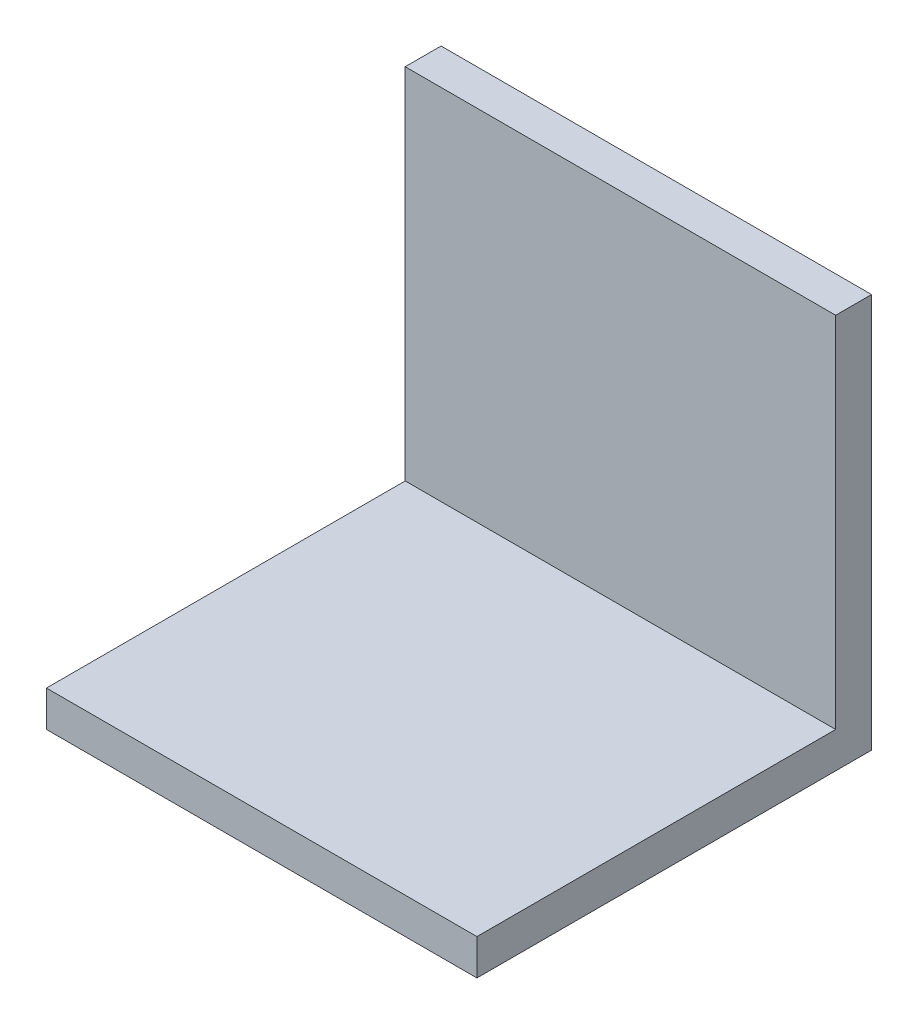
ISO-10303-21;
HEADER;
FILE_DESCRIPTION(('STEP AP214'),'2;1');
FILE_NAME('part.step','',(''),(''),'','','');
FILE_SCHEMA(('AUTOMOTIVE_DESIGN { 1 0 10303 214 1 1 1 1 }'));
ENDSEC;
DATA;
#1=APPLICATION_CONTEXT('core data for automotive mechanical design processes');
#2=APPLICATION_PROTOCOL_DEFINITION('international standard','automotive_design',2000,#1);
#3=PRODUCT_CONTEXT('',#1,'mechanical');
#4=PRODUCT('Part','Part','',(#3));
#5=PRODUCT_RELATED_PRODUCT_CATEGORY('part','',(#4));
#6=PRODUCT_DEFINITION_FORMATION('','',#4);
#7=PRODUCT_DEFINITION_CONTEXT('part definition',#1,'design');
#8=PRODUCT_DEFINITION('design','',#6,#7);
#9=PRODUCT_DEFINITION_SHAPE('','',#8);
#10=(LENGTH_UNIT() NAMED_UNIT(*) SI_UNIT(.MILLI.,.METRE.));
#11=(NAMED_UNIT(*) PLANE_ANGLE_UNIT() SI_UNIT($,.RADIAN.));
#12=(NAMED_UNIT(*) SI_UNIT($,.STERADIAN.) SOLID_ANGLE_UNIT());
#13=UNCERTAINTY_MEASURE_WITH_UNIT(LENGTH_MEASURE(1.E-05),#10,'distance_accuracy_value','');
#14=(GEOMETRIC_REPRESENTATION_CONTEXT(3) GLOBAL_UNCERTAINTY_ASSIGNED_CONTEXT((#13)) GLOBAL_UNIT_ASSIGNED_CONTEXT((#10,
#11,#12)) REPRESENTATION_CONTEXT('',''));
#15=CARTESIAN_POINT('',(0.,0.,0.));
#16=DIRECTION('',(0.,0.,1.));
#17=DIRECTION('',(1.,0.,0.));
#18=AXIS2_PLACEMENT_3D('',#15,#16,#17);
#19=CARTESIAN_POINT('',(0.,0.,3.));
#20=DIRECTION('',(0.,0.,-1.));
#21=DIRECTION('',(-1.,0.,0.));
#22=AXIS2_PLACEMENT_3D('',#19,#20,#21);
#23=PLANE('',#22);
#24=DIRECTION('',(-1.,0.,0.));
#25=VECTOR('',#24,1.);
#26=CARTESIAN_POINT('',(18.,-13.5,3.));
#27=LINE('',#26,#25);
#28=CARTESIAN_POINT('',(18.,-13.5,3.));
#29=VERTEX_POINT('',#28);
#30=CARTESIAN_POINT('',(-18.,-13.5,3.));
#31=VERTEX_POINT('',#30);
#32=EDGE_CURVE('E55',#29,#31,#27,.T.);
#33=ORIENTED_EDGE('',*,*,#32,.F.);
#34=DIRECTION('',(0.,1.,0.));
#35=VECTOR('',#34,1.);
#36=CARTESIAN_POINT('',(18.,16.5,3.));
#37=LINE('',#36,#35);
#38=CARTESIAN_POINT('',(18.,16.5,3.));
#39=VERTEX_POINT('',#38);
#40=EDGE_CURVE('E153',#29,#39,#37,.T.);
#41=ORIENTED_EDGE('',*,*,#40,.T.);
#42=DIRECTION('',(-1.,0.,0.));
#43=VECTOR('',#42,1.);
#44=CARTESIAN_POINT('',(18.,16.5,3.));
#45=LINE('',#44,#43);
#46=CARTESIAN_POINT('',(-18.,16.5,3.));
#47=VERTEX_POINT('',#46);
#48=EDGE_CURVE('E61',#39,#47,#45,.T.);
#49=ORIENTED_EDGE('',*,*,#48,.T.);
#50=DIRECTION('',(0.,-1.,0.));
#51=VECTOR('',#50,1.);
#52=CARTESIAN_POINT('',(-18.,16.5,3.));
#53=LINE('',#52,#51);
#54=EDGE_CURVE('E91',#47,#31,#53,.T.);
#55=ORIENTED_EDGE('',*,*,#54,.T.);
#56=EDGE_LOOP('',(#33,#41,#49,#55));
#57=FACE_BOUND('',#56,.T.);
#58=ADVANCED_FACE('F39',(#57),#23,.F.);
#59=CARTESIAN_POINT('',(-18.,16.5,3.));
#60=DIRECTION('',(1.,0.,0.));
#61=DIRECTION('',(0.,1.,0.));
#62=AXIS2_PLACEMENT_3D('',#59,#60,#61);
#63=PLANE('',#62);
#64=DIRECTION('',(0.,-1.,0.));
#65=VECTOR('',#64,1.);
#66=CARTESIAN_POINT('',(-18.,16.5,0.));
#67=LINE('',#66,#65);
#68=CARTESIAN_POINT('',(-18.,16.5,0.));
#69=VERTEX_POINT('',#68);
#70=CARTESIAN_POINT('',(-18.,-16.5,0.));
#71=VERTEX_POINT('',#70);
#72=EDGE_CURVE('E97',#69,#71,#67,.T.);
#73=ORIENTED_EDGE('',*,*,#72,.T.);
#74=DIRECTION('',(0.,0.,-1.));
#75=VECTOR('',#74,1.);
#76=CARTESIAN_POINT('',(-18.,-16.5,3.));
#77=LINE('',#76,#75);
#78=CARTESIAN_POINT('',(-18.,-16.5,33.));
#79=VERTEX_POINT('',#78);
#80=EDGE_CURVE('E11',#79,#71,#77,.T.);
#81=ORIENTED_EDGE('',*,*,#80,.F.);
#82=DIRECTION('',(0.,-1.,0.));
#83=VECTOR('',#82,1.);
#84=CARTESIAN_POINT('',(-18.,-16.5,33.));
#85=LINE('',#84,#83);
#86=CARTESIAN_POINT('',(-18.,-13.5,33.));
#87=VERTEX_POINT('',#86);
#88=EDGE_CURVE('E140',#87,#79,#85,.T.);
#89=ORIENTED_EDGE('',*,*,#88,.F.);
#90=DIRECTION('',(0.,0.,-1.));
#91=VECTOR('',#90,1.);
#92=CARTESIAN_POINT('',(-18.,-13.5,33.));
#93=LINE('',#92,#91);
#94=EDGE_CURVE('E110',#87,#31,#93,.T.);
#95=ORIENTED_EDGE('',*,*,#94,.T.);
#96=ORIENTED_EDGE('',*,*,#54,.F.);
#97=DIRECTION('',(0.,0.,-1.));
#98=VECTOR('',#97,1.);
#99=CARTESIAN_POINT('',(-18.,16.5,3.));
#100=LINE('',#99,#98);
#101=EDGE_CURVE('E83',#47,#69,#100,.T.);
#102=ORIENTED_EDGE('',*,*,#101,.T.);
#103=EDGE_LOOP('',(#73,#81,#89,#95,#96,#102));
#104=FACE_BOUND('',#103,.T.);
#105=ADVANCED_FACE('F41',(#104),#63,.F.);
#106=CARTESIAN_POINT('',(18.,-16.5,3.));
#107=DIRECTION('',(0.,1.,0.));
#108=DIRECTION('',(-1.,0.,0.));
#109=AXIS2_PLACEMENT_3D('',#106,#107,#108);
#110=PLANE('',#109);
#111=DIRECTION('',(1.,0.,0.));
#112=VECTOR('',#111,1.);
#113=CARTESIAN_POINT('',(18.,-16.5,0.));
#114=LINE('',#113,#112);
#115=CARTESIAN_POINT('',(18.,-16.5,0.));
#116=VERTEX_POINT('',#115);
#117=EDGE_CURVE('E102',#71,#116,#114,.T.);
#118=ORIENTED_EDGE('',*,*,#117,.T.);
#119=DIRECTION('',(0.,0.,-1.));
#120=VECTOR('',#119,1.);
#121=CARTESIAN_POINT('',(18.,-16.5,3.));
#122=LINE('',#121,#120);
#123=CARTESIAN_POINT('',(18.,-16.5,33.));
#124=VERTEX_POINT('',#123);
#125=EDGE_CURVE('E48',#124,#116,#122,.T.);
#126=ORIENTED_EDGE('',*,*,#125,.F.);
#127=DIRECTION('',(1.,0.,0.));
#128=VECTOR('',#127,1.);
#129=CARTESIAN_POINT('',(18.,-16.5,33.));
#130=LINE('',#129,#128);
#131=EDGE_CURVE('E132',#79,#124,#130,.T.);
#132=ORIENTED_EDGE('',*,*,#131,.F.);
#133=ORIENTED_EDGE('',*,*,#80,.T.);
#134=EDGE_LOOP('',(#118,#126,#132,#133));
#135=FACE_BOUND('',#134,.T.);
#136=ADVANCED_FACE('F130',(#135),#110,.F.);
#137=CARTESIAN_POINT('',(18.,16.5,3.));
#138=DIRECTION('',(-1.,0.,0.));
#139=DIRECTION('',(0.,-1.,0.));
#140=AXIS2_PLACEMENT_3D('',#137,#138,#139);
#141=PLANE('',#140);
#142=DIRECTION('',(0.,1.,0.));
#143=VECTOR('',#142,1.);
#144=CARTESIAN_POINT('',(18.,16.5,0.));
#145=LINE('',#144,#143);
#146=CARTESIAN_POINT('',(18.,16.5,0.));
#147=VERTEX_POINT('',#146);
#148=EDGE_CURVE('E92',#116,#147,#145,.T.);
#149=ORIENTED_EDGE('',*,*,#148,.T.);
#150=DIRECTION('',(0.,0.,-1.));
#151=VECTOR('',#150,1.);
#152=CARTESIAN_POINT('',(18.,16.5,3.));
#153=LINE('',#152,#151);
#154=EDGE_CURVE('E86',#39,#147,#153,.T.);
#155=ORIENTED_EDGE('',*,*,#154,.F.);
#156=ORIENTED_EDGE('',*,*,#40,.F.);
#157=DIRECTION('',(0.,0.,-1.));
#158=VECTOR('',#157,1.);
#159=CARTESIAN_POINT('',(18.,-13.5,33.));
#160=LINE('',#159,#158);
#161=CARTESIAN_POINT('',(18.,-13.5,33.));
#162=VERTEX_POINT('',#161);
#163=EDGE_CURVE('E104',#162,#29,#160,.T.);
#164=ORIENTED_EDGE('',*,*,#163,.F.);
#165=DIRECTION('',(0.,1.,0.));
#166=VECTOR('',#165,1.);
#167=CARTESIAN_POINT('',(18.,-16.5,33.));
#168=LINE('',#167,#166);
#169=EDGE_CURVE('E126',#124,#162,#168,.T.);
#170=ORIENTED_EDGE('',*,*,#169,.F.);
#171=ORIENTED_EDGE('',*,*,#125,.T.);
#172=EDGE_LOOP('',(#149,#155,#156,#164,#170,#171));
#173=FACE_BOUND('',#172,.T.);
#174=ADVANCED_FACE('F123',(#173),#141,.F.);
#175=CARTESIAN_POINT('',(18.,16.5,3.));
#176=DIRECTION('',(0.,-1.,0.));
#177=DIRECTION('',(0.,0.,-1.));
#178=AXIS2_PLACEMENT_3D('',#175,#176,#177);
#179=PLANE('',#178);
#180=DIRECTION('',(-1.,0.,0.));
#181=VECTOR('',#180,1.);
#182=CARTESIAN_POINT('',(18.,16.5,0.));
#183=LINE('',#182,#181);
#184=EDGE_CURVE('E80',#147,#69,#183,.T.);
#185=ORIENTED_EDGE('',*,*,#184,.T.);
#186=ORIENTED_EDGE('',*,*,#101,.F.);
#187=ORIENTED_EDGE('',*,*,#48,.F.);
#188=ORIENTED_EDGE('',*,*,#154,.T.);
#189=EDGE_LOOP('',(#185,#186,#187,#188));
#190=FACE_BOUND('',#189,.T.);
#191=ADVANCED_FACE('F82',(#190),#179,.F.);
#192=CARTESIAN_POINT('',(0.,0.,0.));
#193=DIRECTION('',(0.,0.,-1.));
#194=DIRECTION('',(-1.,0.,0.));
#195=AXIS2_PLACEMENT_3D('',#192,#193,#194);
#196=PLANE('',#195);
#197=ORIENTED_EDGE('',*,*,#72,.F.);
#198=ORIENTED_EDGE('',*,*,#184,.F.);
#199=ORIENTED_EDGE('',*,*,#148,.F.);
#200=ORIENTED_EDGE('',*,*,#117,.F.);
#201=EDGE_LOOP('',(#197,#198,#199,#200));
#202=FACE_BOUND('',#201,.T.);
#203=ADVANCED_FACE('F101',(#202),#196,.T.);
#204=CARTESIAN_POINT('',(18.,-13.5,33.));
#205=DIRECTION('',(0.,-1.,0.));
#206=DIRECTION('',(1.,0.,0.));
#207=AXIS2_PLACEMENT_3D('',#204,#205,#206);
#208=PLANE('',#207);
#209=ORIENTED_EDGE('',*,*,#32,.T.);
#210=ORIENTED_EDGE('',*,*,#94,.F.);
#211=DIRECTION('',(-1.,0.,0.));
#212=VECTOR('',#211,1.);
#213=CARTESIAN_POINT('',(18.,-13.5,33.));
#214=LINE('',#213,#212);
#215=EDGE_CURVE('E146',#162,#87,#214,.T.);
#216=ORIENTED_EDGE('',*,*,#215,.F.);
#217=ORIENTED_EDGE('',*,*,#163,.T.);
#218=EDGE_LOOP('',(#209,#210,#216,#217));
#219=FACE_BOUND('',#218,.T.);
#220=ADVANCED_FACE('F158',(#219),#208,.F.);
#221=CARTESIAN_POINT('',(0.,0.,33.));
#222=DIRECTION('',(0.,0.,1.));
#223=DIRECTION('',(1.,0.,0.));
#224=AXIS2_PLACEMENT_3D('',#221,#222,#223);
#225=PLANE('',#224);
#226=ORIENTED_EDGE('',*,*,#169,.T.);
#227=ORIENTED_EDGE('',*,*,#215,.T.);
#228=ORIENTED_EDGE('',*,*,#88,.T.);
#229=ORIENTED_EDGE('',*,*,#131,.T.);
#230=EDGE_LOOP('',(#226,#227,#228,#229));
#231=FACE_BOUND('',#230,.T.);
#232=ADVANCED_FACE('F136',(#231),#225,.T.);
#233=CLOSED_SHELL('',(#58,#105,#136,#174,#191,#203,#220,#232));
#234=MANIFOLD_SOLID_BREP('B2',#233);
#235=ADVANCED_BREP_SHAPE_REPRESENTATION('',(#18,#234),#14);
#236=SHAPE_DEFINITION_REPRESENTATION(#9,#235);
ENDSEC;
END-ISO-10303-21;
